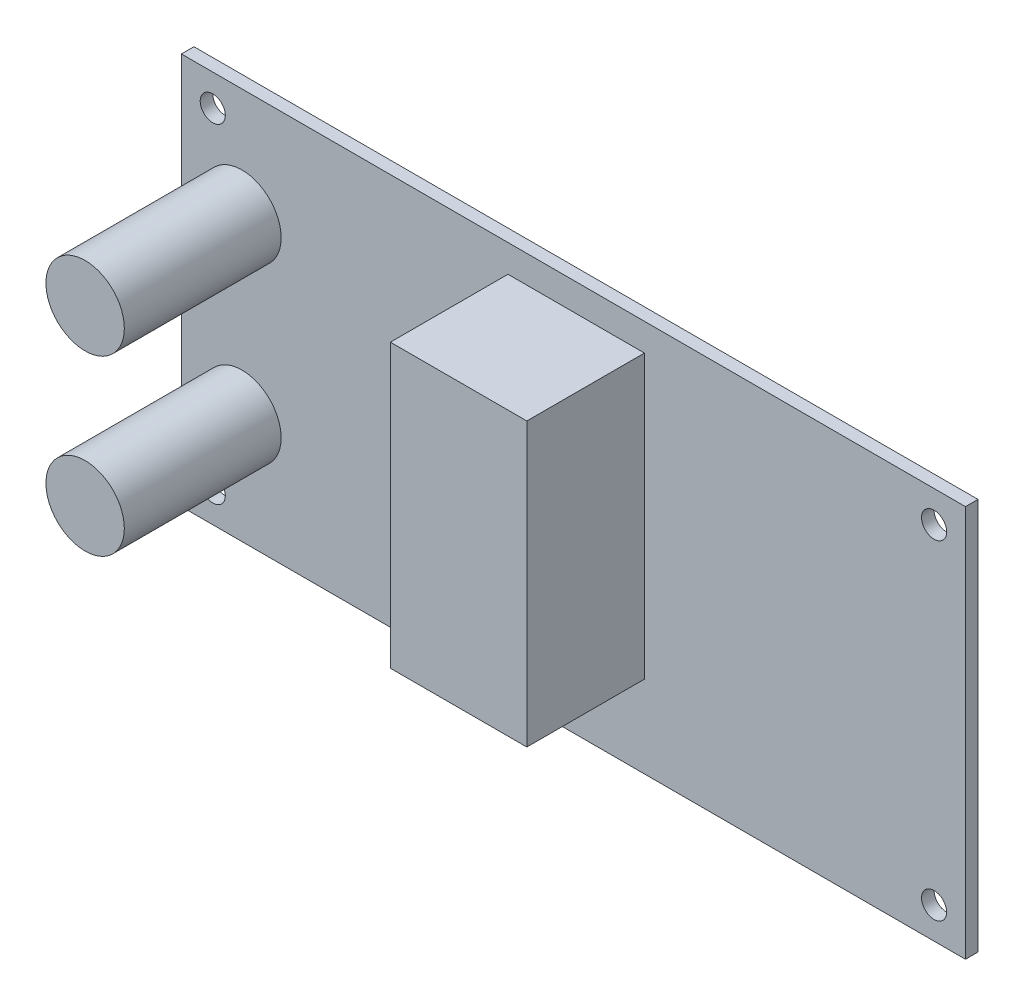
ISO-10303-21;
HEADER;
FILE_DESCRIPTION(('STEP AP214'),'2;1');
FILE_NAME('part.step','',(''),(''),'','','');
FILE_SCHEMA(('AUTOMOTIVE_DESIGN { 1 0 10303 214 1 1 1 1 }'));
ENDSEC;
DATA;
#1=APPLICATION_CONTEXT('core data for automotive mechanical design processes');
#2=APPLICATION_PROTOCOL_DEFINITION('international standard','automotive_design',2000,#1);
#3=PRODUCT_CONTEXT('',#1,'mechanical');
#4=PRODUCT('Part','Part','',(#3));
#5=PRODUCT_RELATED_PRODUCT_CATEGORY('part','',(#4));
#6=PRODUCT_DEFINITION_FORMATION('','',#4);
#7=PRODUCT_DEFINITION_CONTEXT('part definition',#1,'design');
#8=PRODUCT_DEFINITION('design','',#6,#7);
#9=PRODUCT_DEFINITION_SHAPE('','',#8);
#10=(LENGTH_UNIT() NAMED_UNIT(*) SI_UNIT(.MILLI.,.METRE.));
#11=(NAMED_UNIT(*) PLANE_ANGLE_UNIT() SI_UNIT($,.RADIAN.));
#12=(NAMED_UNIT(*) SI_UNIT($,.STERADIAN.) SOLID_ANGLE_UNIT());
#13=UNCERTAINTY_MEASURE_WITH_UNIT(LENGTH_MEASURE(1.E-05),#10,'distance_accuracy_value','');
#14=(GEOMETRIC_REPRESENTATION_CONTEXT(3) GLOBAL_UNCERTAINTY_ASSIGNED_CONTEXT((#13)) GLOBAL_UNIT_ASSIGNED_CONTEXT((#10,
#11,#12)) REPRESENTATION_CONTEXT('',''));
#15=CARTESIAN_POINT('',(0.,0.,0.));
#16=DIRECTION('',(0.,0.,1.));
#17=DIRECTION('',(1.,0.,0.));
#18=AXIS2_PLACEMENT_3D('',#15,#16,#17);
#19=CARTESIAN_POINT('',(0.,0.,1.6));
#20=DIRECTION('',(0.,0.,1.));
#21=DIRECTION('',(1.,0.,0.));
#22=AXIS2_PLACEMENT_3D('',#19,#20,#21);
#23=PLANE('',#22);
#24=CARTESIAN_POINT('',(-42.2779913170643,-11.0526398991411,1.6));
#25=DIRECTION('',(0.,0.,1.));
#26=DIRECTION('',(1.,0.,0.));
#27=AXIS2_PLACEMENT_3D('',#24,#25,#26);
#28=CIRCLE('',#27,5.);
#29=CARTESIAN_POINT('',(-37.2779913170643,-11.0526398991411,1.6));
#30=VERTEX_POINT('',#29);
#31=EDGE_CURVE('E132',#30,#30,#28,.T.);
#32=ORIENTED_EDGE('',*,*,#31,.F.);
#33=EDGE_LOOP('',(#32));
#34=FACE_BOUND('',#33,.T.);
#35=CARTESIAN_POINT('',(-42.2779913170643,11.0526398991411,1.6));
#36=DIRECTION('',(0.,0.,1.));
#37=DIRECTION('',(1.,0.,0.));
#38=AXIS2_PLACEMENT_3D('',#35,#36,#37);
#39=CIRCLE('',#38,5.);
#40=CARTESIAN_POINT('',(-37.2779913170643,11.0526398991411,1.6));
#41=VERTEX_POINT('',#40);
#42=EDGE_CURVE('E141',#41,#41,#39,.T.);
#43=ORIENTED_EDGE('',*,*,#42,.F.);
#44=EDGE_LOOP('',(#43));
#45=FACE_BOUND('',#44,.T.);
#46=CARTESIAN_POINT('',(46.,-21.,1.6));
#47=DIRECTION('',(0.,0.,1.));
#48=DIRECTION('',(1.,0.,0.));
#49=AXIS2_PLACEMENT_3D('',#46,#47,#48);
#50=CIRCLE('',#49,1.6);
#51=CARTESIAN_POINT('',(47.6,-21.,1.6));
#52=VERTEX_POINT('',#51);
#53=EDGE_CURVE('E155',#52,#52,#50,.T.);
#54=ORIENTED_EDGE('',*,*,#53,.F.);
#55=EDGE_LOOP('',(#54));
#56=FACE_BOUND('',#55,.T.);
#57=CARTESIAN_POINT('',(-46.,21.,1.6));
#58=DIRECTION('',(0.,0.,1.));
#59=DIRECTION('',(1.,0.,0.));
#60=AXIS2_PLACEMENT_3D('',#57,#58,#59);
#61=CIRCLE('',#60,1.6);
#62=CARTESIAN_POINT('',(-44.4,21.,1.6));
#63=VERTEX_POINT('',#62);
#64=EDGE_CURVE('E167',#63,#63,#61,.T.);
#65=ORIENTED_EDGE('',*,*,#64,.F.);
#66=EDGE_LOOP('',(#65));
#67=FACE_BOUND('',#66,.T.);
#68=DIRECTION('',(0.,-1.,0.));
#69=VECTOR('',#68,1.);
#70=CARTESIAN_POINT('',(-50.,25.,1.6));
#71=LINE('',#70,#69);
#72=CARTESIAN_POINT('',(-50.,25.,1.6));
#73=VERTEX_POINT('',#72);
#74=CARTESIAN_POINT('',(-50.,-25.,1.6));
#75=VERTEX_POINT('',#74);
#76=EDGE_CURVE('E173',#73,#75,#71,.T.);
#77=ORIENTED_EDGE('',*,*,#76,.T.);
#78=DIRECTION('',(1.,0.,0.));
#79=VECTOR('',#78,1.);
#80=CARTESIAN_POINT('',(-50.,-25.,1.6));
#81=LINE('',#80,#79);
#82=CARTESIAN_POINT('',(50.,-25.,1.6));
#83=VERTEX_POINT('',#82);
#84=EDGE_CURVE('E85',#75,#83,#81,.T.);
#85=ORIENTED_EDGE('',*,*,#84,.T.);
#86=DIRECTION('',(0.,1.,0.));
#87=VECTOR('',#86,1.);
#88=CARTESIAN_POINT('',(50.,25.,1.6));
#89=LINE('',#88,#87);
#90=CARTESIAN_POINT('',(50.,25.,1.6));
#91=VERTEX_POINT('',#90);
#92=EDGE_CURVE('E176',#83,#91,#89,.T.);
#93=ORIENTED_EDGE('',*,*,#92,.T.);
#94=DIRECTION('',(-1.,0.,0.));
#95=VECTOR('',#94,1.);
#96=CARTESIAN_POINT('',(-50.,25.,1.6));
#97=LINE('',#96,#95);
#98=EDGE_CURVE('E57',#91,#73,#97,.T.);
#99=ORIENTED_EDGE('',*,*,#98,.T.);
#100=EDGE_LOOP('',(#77,#85,#93,#99));
#101=FACE_BOUND('',#100,.T.);
#102=CARTESIAN_POINT('',(46.,21.,1.6));
#103=DIRECTION('',(0.,0.,1.));
#104=DIRECTION('',(1.,0.,0.));
#105=AXIS2_PLACEMENT_3D('',#102,#103,#104);
#106=CIRCLE('',#105,1.6);
#107=CARTESIAN_POINT('',(47.6,21.,1.6));
#108=VERTEX_POINT('',#107);
#109=EDGE_CURVE('E161',#108,#108,#106,.T.);
#110=ORIENTED_EDGE('',*,*,#109,.F.);
#111=EDGE_LOOP('',(#110));
#112=FACE_BOUND('',#111,.T.);
#113=CARTESIAN_POINT('',(-46.,-21.,1.6));
#114=DIRECTION('',(0.,0.,1.));
#115=DIRECTION('',(1.,0.,0.));
#116=AXIS2_PLACEMENT_3D('',#113,#114,#115);
#117=CIRCLE('',#116,1.6);
#118=CARTESIAN_POINT('',(-44.4,-21.,1.6));
#119=VERTEX_POINT('',#118);
#120=EDGE_CURVE('E149',#119,#119,#117,.T.);
#121=ORIENTED_EDGE('',*,*,#120,.F.);
#122=EDGE_LOOP('',(#121));
#123=FACE_BOUND('',#122,.T.);
#124=DIRECTION('',(1.,0.,0.));
#125=VECTOR('',#124,1.);
#126=CARTESIAN_POINT('',(-8.3462200102673,-14.5275744955313,1.6));
#127=LINE('',#126,#125);
#128=CARTESIAN_POINT('',(-8.3462200102673,-14.5275744955313,1.6));
#129=VERTEX_POINT('',#128);
#130=CARTESIAN_POINT('',(9.05658044007396,-14.5275744955313,1.6));
#131=VERTEX_POINT('',#130);
#132=EDGE_CURVE('E383',#129,#131,#127,.T.);
#133=ORIENTED_EDGE('',*,*,#132,.F.);
#134=DIRECTION('',(0.,-1.,0.));
#135=VECTOR('',#134,1.);
#136=CARTESIAN_POINT('',(-8.3462200102673,21.4909556415677,1.6));
#137=LINE('',#136,#135);
#138=CARTESIAN_POINT('',(-8.3462200102673,21.4909556415677,1.6));
#139=VERTEX_POINT('',#138);
#140=EDGE_CURVE('E130',#139,#129,#137,.T.);
#141=ORIENTED_EDGE('',*,*,#140,.F.);
#142=DIRECTION('',(-1.,0.,0.));
#143=VECTOR('',#142,1.);
#144=CARTESIAN_POINT('',(-8.3462200102673,21.4909556415677,1.6));
#145=LINE('',#144,#143);
#146=CARTESIAN_POINT('',(9.05658044007396,21.4909556415677,1.6));
#147=VERTEX_POINT('',#146);
#148=EDGE_CURVE('E126',#147,#139,#145,.T.);
#149=ORIENTED_EDGE('',*,*,#148,.F.);
#150=DIRECTION('',(0.,1.,0.));
#151=VECTOR('',#150,1.);
#152=CARTESIAN_POINT('',(9.05658044007396,21.4909556415677,1.6));
#153=LINE('',#152,#151);
#154=EDGE_CURVE('E380',#131,#147,#153,.T.);
#155=ORIENTED_EDGE('',*,*,#154,.F.);
#156=EDGE_LOOP('',(#133,#141,#149,#155));
#157=FACE_BOUND('',#156,.T.);
#158=ADVANCED_FACE('F33',(#34,#45,#56,#67,#101,#112,#123,#157),#23,.T.);
#159=CARTESIAN_POINT('',(0.,0.,0.));
#160=DIRECTION('',(0.,0.,1.));
#161=DIRECTION('',(1.,0.,0.));
#162=AXIS2_PLACEMENT_3D('',#159,#160,#161);
#163=PLANE('',#162);
#164=DIRECTION('',(0.,-1.,0.));
#165=VECTOR('',#164,1.);
#166=CARTESIAN_POINT('',(-50.,25.,0.));
#167=LINE('',#166,#165);
#168=CARTESIAN_POINT('',(-50.,25.,0.));
#169=VERTEX_POINT('',#168);
#170=CARTESIAN_POINT('',(-50.,-25.,0.));
#171=VERTEX_POINT('',#170);
#172=EDGE_CURVE('E170',#169,#171,#167,.T.);
#173=ORIENTED_EDGE('',*,*,#172,.F.);
#174=DIRECTION('',(-1.,0.,0.));
#175=VECTOR('',#174,1.);
#176=CARTESIAN_POINT('',(-50.,25.,0.));
#177=LINE('',#176,#175);
#178=CARTESIAN_POINT('',(50.,25.,0.));
#179=VERTEX_POINT('',#178);
#180=EDGE_CURVE('E78',#179,#169,#177,.T.);
#181=ORIENTED_EDGE('',*,*,#180,.F.);
#182=DIRECTION('',(0.,1.,0.));
#183=VECTOR('',#182,1.);
#184=CARTESIAN_POINT('',(50.,25.,0.));
#185=LINE('',#184,#183);
#186=CARTESIAN_POINT('',(50.,-25.,0.));
#187=VERTEX_POINT('',#186);
#188=EDGE_CURVE('E184',#187,#179,#185,.T.);
#189=ORIENTED_EDGE('',*,*,#188,.F.);
#190=DIRECTION('',(1.,0.,0.));
#191=VECTOR('',#190,1.);
#192=CARTESIAN_POINT('',(-50.,-25.,0.));
#193=LINE('',#192,#191);
#194=EDGE_CURVE('E182',#171,#187,#193,.T.);
#195=ORIENTED_EDGE('',*,*,#194,.F.);
#196=EDGE_LOOP('',(#173,#181,#189,#195));
#197=FACE_BOUND('',#196,.T.);
#198=CARTESIAN_POINT('',(-46.,21.,0.));
#199=DIRECTION('',(0.,0.,1.));
#200=DIRECTION('',(1.,0.,0.));
#201=AXIS2_PLACEMENT_3D('',#198,#199,#200);
#202=CIRCLE('',#201,1.6);
#203=CARTESIAN_POINT('',(-44.4,21.,0.));
#204=VERTEX_POINT('',#203);
#205=EDGE_CURVE('E164',#204,#204,#202,.T.);
#206=ORIENTED_EDGE('',*,*,#205,.T.);
#207=EDGE_LOOP('',(#206));
#208=FACE_BOUND('',#207,.T.);
#209=CARTESIAN_POINT('',(46.,21.,0.));
#210=DIRECTION('',(0.,0.,1.));
#211=DIRECTION('',(1.,0.,0.));
#212=AXIS2_PLACEMENT_3D('',#209,#210,#211);
#213=CIRCLE('',#212,1.6);
#214=CARTESIAN_POINT('',(47.6,21.,0.));
#215=VERTEX_POINT('',#214);
#216=EDGE_CURVE('E158',#215,#215,#213,.T.);
#217=ORIENTED_EDGE('',*,*,#216,.T.);
#218=EDGE_LOOP('',(#217));
#219=FACE_BOUND('',#218,.T.);
#220=CARTESIAN_POINT('',(46.,-21.,0.));
#221=DIRECTION('',(0.,0.,1.));
#222=DIRECTION('',(1.,0.,0.));
#223=AXIS2_PLACEMENT_3D('',#220,#221,#222);
#224=CIRCLE('',#223,1.6);
#225=CARTESIAN_POINT('',(47.6,-21.,0.));
#226=VERTEX_POINT('',#225);
#227=EDGE_CURVE('E152',#226,#226,#224,.T.);
#228=ORIENTED_EDGE('',*,*,#227,.T.);
#229=EDGE_LOOP('',(#228));
#230=FACE_BOUND('',#229,.T.);
#231=CARTESIAN_POINT('',(-46.,-21.,0.));
#232=DIRECTION('',(0.,0.,1.));
#233=DIRECTION('',(1.,0.,0.));
#234=AXIS2_PLACEMENT_3D('',#231,#232,#233);
#235=CIRCLE('',#234,1.6);
#236=CARTESIAN_POINT('',(-44.4,-21.,0.));
#237=VERTEX_POINT('',#236);
#238=EDGE_CURVE('E146',#237,#237,#235,.T.);
#239=ORIENTED_EDGE('',*,*,#238,.T.);
#240=EDGE_LOOP('',(#239));
#241=FACE_BOUND('',#240,.T.);
#242=ADVANCED_FACE('F197',(#197,#208,#219,#230,#241),#163,.F.);
#243=CARTESIAN_POINT('',(-50.,25.,1.6));
#244=DIRECTION('',(1.,0.,0.));
#245=DIRECTION('',(0.,0.,-1.));
#246=AXIS2_PLACEMENT_3D('',#243,#244,#245);
#247=PLANE('',#246);
#248=ORIENTED_EDGE('',*,*,#172,.T.);
#249=DIRECTION('',(0.,0.,-1.));
#250=VECTOR('',#249,1.);
#251=CARTESIAN_POINT('',(-50.,-25.,1.6));
#252=LINE('',#251,#250);
#253=EDGE_CURVE('E11',#75,#171,#252,.T.);
#254=ORIENTED_EDGE('',*,*,#253,.F.);
#255=ORIENTED_EDGE('',*,*,#76,.F.);
#256=DIRECTION('',(0.,0.,-1.));
#257=VECTOR('',#256,1.);
#258=CARTESIAN_POINT('',(-50.,25.,1.6));
#259=LINE('',#258,#257);
#260=EDGE_CURVE('E179',#73,#169,#259,.T.);
#261=ORIENTED_EDGE('',*,*,#260,.T.);
#262=EDGE_LOOP('',(#248,#254,#255,#261));
#263=FACE_BOUND('',#262,.T.);
#264=ADVANCED_FACE('F35',(#263),#247,.F.);
#265=CARTESIAN_POINT('',(-50.,-25.,1.6));
#266=DIRECTION('',(0.,1.,0.));
#267=DIRECTION('',(0.,0.,1.));
#268=AXIS2_PLACEMENT_3D('',#265,#266,#267);
#269=PLANE('',#268);
#270=ORIENTED_EDGE('',*,*,#194,.T.);
#271=DIRECTION('',(0.,0.,-1.));
#272=VECTOR('',#271,1.);
#273=CARTESIAN_POINT('',(50.,-25.,1.6));
#274=LINE('',#273,#272);
#275=EDGE_CURVE('E41',#83,#187,#274,.T.);
#276=ORIENTED_EDGE('',*,*,#275,.F.);
#277=ORIENTED_EDGE('',*,*,#84,.F.);
#278=ORIENTED_EDGE('',*,*,#253,.T.);
#279=EDGE_LOOP('',(#270,#276,#277,#278));
#280=FACE_BOUND('',#279,.T.);
#281=ADVANCED_FACE('F213',(#280),#269,.F.);
#282=CARTESIAN_POINT('',(50.,25.,1.6));
#283=DIRECTION('',(-1.,0.,0.));
#284=DIRECTION('',(0.,0.,1.));
#285=AXIS2_PLACEMENT_3D('',#282,#283,#284);
#286=PLANE('',#285);
#287=ORIENTED_EDGE('',*,*,#188,.T.);
#288=DIRECTION('',(0.,0.,-1.));
#289=VECTOR('',#288,1.);
#290=CARTESIAN_POINT('',(50.,25.,1.6));
#291=LINE('',#290,#289);
#292=EDGE_CURVE('E188',#91,#179,#291,.T.);
#293=ORIENTED_EDGE('',*,*,#292,.F.);
#294=ORIENTED_EDGE('',*,*,#92,.F.);
#295=ORIENTED_EDGE('',*,*,#275,.T.);
#296=EDGE_LOOP('',(#287,#293,#294,#295));
#297=FACE_BOUND('',#296,.T.);
#298=ADVANCED_FACE('F193',(#297),#286,.F.);
#299=CARTESIAN_POINT('',(-50.,25.,1.6));
#300=DIRECTION('',(0.,-1.,0.));
#301=DIRECTION('',(0.,0.,-1.));
#302=AXIS2_PLACEMENT_3D('',#299,#300,#301);
#303=PLANE('',#302);
#304=ORIENTED_EDGE('',*,*,#180,.T.);
#305=ORIENTED_EDGE('',*,*,#260,.F.);
#306=ORIENTED_EDGE('',*,*,#98,.F.);
#307=ORIENTED_EDGE('',*,*,#292,.T.);
#308=EDGE_LOOP('',(#304,#305,#306,#307));
#309=FACE_BOUND('',#308,.T.);
#310=ADVANCED_FACE('F202',(#309),#303,.F.);
#311=CARTESIAN_POINT('',(-46.,21.,1.6));
#312=DIRECTION('',(0.,0.,-1.));
#313=DIRECTION('',(-1.,0.,0.));
#314=AXIS2_PLACEMENT_3D('',#311,#312,#313);
#315=CYLINDRICAL_SURFACE('',#314,1.6);
#316=ORIENTED_EDGE('',*,*,#64,.T.);
#317=EDGE_LOOP('',(#316));
#318=FACE_BOUND('',#317,.T.);
#319=ORIENTED_EDGE('',*,*,#205,.F.);
#320=EDGE_LOOP('',(#319));
#321=FACE_BOUND('',#320,.T.);
#322=ADVANCED_FACE('F204',(#318,#321),#315,.F.);
#323=CARTESIAN_POINT('',(46.,21.,1.6));
#324=DIRECTION('',(0.,0.,-1.));
#325=DIRECTION('',(-1.,0.,0.));
#326=AXIS2_PLACEMENT_3D('',#323,#324,#325);
#327=CYLINDRICAL_SURFACE('',#326,1.6);
#328=ORIENTED_EDGE('',*,*,#109,.T.);
#329=EDGE_LOOP('',(#328));
#330=FACE_BOUND('',#329,.T.);
#331=ORIENTED_EDGE('',*,*,#216,.F.);
#332=EDGE_LOOP('',(#331));
#333=FACE_BOUND('',#332,.T.);
#334=ADVANCED_FACE('F210',(#330,#333),#327,.F.);
#335=CARTESIAN_POINT('',(46.,-21.,1.6));
#336=DIRECTION('',(0.,0.,-1.));
#337=DIRECTION('',(-1.,0.,0.));
#338=AXIS2_PLACEMENT_3D('',#335,#336,#337);
#339=CYLINDRICAL_SURFACE('',#338,1.6);
#340=ORIENTED_EDGE('',*,*,#53,.T.);
#341=EDGE_LOOP('',(#340));
#342=FACE_BOUND('',#341,.T.);
#343=ORIENTED_EDGE('',*,*,#227,.F.);
#344=EDGE_LOOP('',(#343));
#345=FACE_BOUND('',#344,.T.);
#346=ADVANCED_FACE('F227',(#342,#345),#339,.F.);
#347=CARTESIAN_POINT('',(-46.,-21.,1.6));
#348=DIRECTION('',(0.,0.,-1.));
#349=DIRECTION('',(-1.,0.,0.));
#350=AXIS2_PLACEMENT_3D('',#347,#348,#349);
#351=CYLINDRICAL_SURFACE('',#350,1.6);
#352=ORIENTED_EDGE('',*,*,#120,.T.);
#353=EDGE_LOOP('',(#352));
#354=FACE_BOUND('',#353,.T.);
#355=ORIENTED_EDGE('',*,*,#238,.F.);
#356=EDGE_LOOP('',(#355));
#357=FACE_BOUND('',#356,.T.);
#358=ADVANCED_FACE('F231',(#354,#357),#351,.F.);
#359=CARTESIAN_POINT('',(-42.2779913170643,11.0526398991411,21.6));
#360=DIRECTION('',(0.,0.,-1.));
#361=DIRECTION('',(-1.,0.,0.));
#362=AXIS2_PLACEMENT_3D('',#359,#360,#361);
#363=CYLINDRICAL_SURFACE('',#362,5.);
#364=CARTESIAN_POINT('',(-42.2779913170643,11.0526398991411,21.6));
#365=DIRECTION('',(0.,0.,1.));
#366=DIRECTION('',(1.,0.,0.));
#367=AXIS2_PLACEMENT_3D('',#364,#365,#366);
#368=CIRCLE('',#367,5.);
#369=CARTESIAN_POINT('',(-37.2779913170643,11.0526398991411,21.6));
#370=VERTEX_POINT('',#369);
#371=EDGE_CURVE('E143',#370,#370,#368,.T.);
#372=ORIENTED_EDGE('',*,*,#371,.F.);
#373=EDGE_LOOP('',(#372));
#374=FACE_BOUND('',#373,.T.);
#375=ORIENTED_EDGE('',*,*,#42,.T.);
#376=EDGE_LOOP('',(#375));
#377=FACE_BOUND('',#376,.T.);
#378=ADVANCED_FACE('F235',(#374,#377),#363,.T.);
#379=CARTESIAN_POINT('',(-42.2779913170643,11.0526398991411,21.6));
#380=DIRECTION('',(0.,0.,1.));
#381=DIRECTION('',(1.,0.,0.));
#382=AXIS2_PLACEMENT_3D('',#379,#380,#381);
#383=PLANE('',#382);
#384=ORIENTED_EDGE('',*,*,#371,.T.);
#385=EDGE_LOOP('',(#384));
#386=FACE_BOUND('',#385,.T.);
#387=ADVANCED_FACE('F239',(#386),#383,.T.);
#388=CARTESIAN_POINT('',(-42.2779913170643,-11.0526398991411,21.6));
#389=DIRECTION('',(0.,0.,-1.));
#390=DIRECTION('',(-1.,0.,0.));
#391=AXIS2_PLACEMENT_3D('',#388,#389,#390);
#392=CYLINDRICAL_SURFACE('',#391,5.);
#393=CARTESIAN_POINT('',(-42.2779913170643,-11.0526398991411,21.6));
#394=DIRECTION('',(0.,0.,1.));
#395=DIRECTION('',(1.,0.,0.));
#396=AXIS2_PLACEMENT_3D('',#393,#394,#395);
#397=CIRCLE('',#396,5.);
#398=CARTESIAN_POINT('',(-37.2779913170643,-11.0526398991411,21.6));
#399=VERTEX_POINT('',#398);
#400=EDGE_CURVE('E135',#399,#399,#397,.T.);
#401=ORIENTED_EDGE('',*,*,#400,.F.);
#402=EDGE_LOOP('',(#401));
#403=FACE_BOUND('',#402,.T.);
#404=ORIENTED_EDGE('',*,*,#31,.T.);
#405=EDGE_LOOP('',(#404));
#406=FACE_BOUND('',#405,.T.);
#407=ADVANCED_FACE('F243',(#403,#406),#392,.T.);
#408=CARTESIAN_POINT('',(-42.2779913170643,-11.0526398991411,21.6));
#409=DIRECTION('',(0.,0.,1.));
#410=DIRECTION('',(1.,0.,0.));
#411=AXIS2_PLACEMENT_3D('',#408,#409,#410);
#412=PLANE('',#411);
#413=ORIENTED_EDGE('',*,*,#400,.T.);
#414=EDGE_LOOP('',(#413));
#415=FACE_BOUND('',#414,.T.);
#416=ADVANCED_FACE('F247',(#415),#412,.T.);
#417=CARTESIAN_POINT('',(-8.3462200102673,21.4909556415677,16.6));
#418=DIRECTION('',(1.,0.,0.));
#419=DIRECTION('',(0.,0.,-1.));
#420=AXIS2_PLACEMENT_3D('',#417,#418,#419);
#421=PLANE('',#420);
#422=ORIENTED_EDGE('',*,*,#140,.T.);
#423=DIRECTION('',(0.,0.,-1.));
#424=VECTOR('',#423,1.);
#425=CARTESIAN_POINT('',(-8.3462200102673,-14.5275744955313,16.6));
#426=LINE('',#425,#424);
#427=CARTESIAN_POINT('',(-8.3462200102673,-14.5275744955313,16.6));
#428=VERTEX_POINT('',#427);
#429=EDGE_CURVE('E111',#428,#129,#426,.T.);
#430=ORIENTED_EDGE('',*,*,#429,.F.);
#431=DIRECTION('',(0.,-1.,0.));
#432=VECTOR('',#431,1.);
#433=CARTESIAN_POINT('',(-8.3462200102673,21.4909556415677,16.6));
#434=LINE('',#433,#432);
#435=CARTESIAN_POINT('',(-8.3462200102673,21.4909556415677,16.6));
#436=VERTEX_POINT('',#435);
#437=EDGE_CURVE('E118',#436,#428,#434,.T.);
#438=ORIENTED_EDGE('',*,*,#437,.F.);
#439=DIRECTION('',(0.,0.,-1.));
#440=VECTOR('',#439,1.);
#441=CARTESIAN_POINT('',(-8.3462200102673,21.4909556415677,16.6));
#442=LINE('',#441,#440);
#443=EDGE_CURVE('E377',#436,#139,#442,.T.);
#444=ORIENTED_EDGE('',*,*,#443,.T.);
#445=EDGE_LOOP('',(#422,#430,#438,#444));
#446=FACE_BOUND('',#445,.T.);
#447=ADVANCED_FACE('F128',(#446),#421,.F.);
#448=CARTESIAN_POINT('',(-8.3462200102673,-14.5275744955313,16.6));
#449=DIRECTION('',(0.,1.,0.));
#450=DIRECTION('',(0.,0.,1.));
#451=AXIS2_PLACEMENT_3D('',#448,#449,#450);
#452=PLANE('',#451);
#453=ORIENTED_EDGE('',*,*,#132,.T.);
#454=DIRECTION('',(0.,0.,-1.));
#455=VECTOR('',#454,1.);
#456=CARTESIAN_POINT('',(9.05658044007396,-14.5275744955313,16.6));
#457=LINE('',#456,#455);
#458=CARTESIAN_POINT('',(9.05658044007396,-14.5275744955313,16.6));
#459=VERTEX_POINT('',#458);
#460=EDGE_CURVE('E114',#459,#131,#457,.T.);
#461=ORIENTED_EDGE('',*,*,#460,.F.);
#462=DIRECTION('',(1.,0.,0.));
#463=VECTOR('',#462,1.);
#464=CARTESIAN_POINT('',(-8.3462200102673,-14.5275744955313,16.6));
#465=LINE('',#464,#463);
#466=EDGE_CURVE('E107',#428,#459,#465,.T.);
#467=ORIENTED_EDGE('',*,*,#466,.F.);
#468=ORIENTED_EDGE('',*,*,#429,.T.);
#469=EDGE_LOOP('',(#453,#461,#467,#468));
#470=FACE_BOUND('',#469,.T.);
#471=ADVANCED_FACE('F109',(#470),#452,.F.);
#472=CARTESIAN_POINT('',(9.05658044007396,21.4909556415677,16.6));
#473=DIRECTION('',(-1.,0.,0.));
#474=DIRECTION('',(0.,0.,1.));
#475=AXIS2_PLACEMENT_3D('',#472,#473,#474);
#476=PLANE('',#475);
#477=ORIENTED_EDGE('',*,*,#154,.T.);
#478=DIRECTION('',(0.,0.,-1.));
#479=VECTOR('',#478,1.);
#480=CARTESIAN_POINT('',(9.05658044007396,21.4909556415677,16.6));
#481=LINE('',#480,#479);
#482=CARTESIAN_POINT('',(9.05658044007396,21.4909556415677,16.6));
#483=VERTEX_POINT('',#482);
#484=EDGE_CURVE('E48',#483,#147,#481,.T.);
#485=ORIENTED_EDGE('',*,*,#484,.F.);
#486=DIRECTION('',(0.,1.,0.));
#487=VECTOR('',#486,1.);
#488=CARTESIAN_POINT('',(9.05658044007396,21.4909556415677,16.6));
#489=LINE('',#488,#487);
#490=EDGE_CURVE('E117',#459,#483,#489,.T.);
#491=ORIENTED_EDGE('',*,*,#490,.F.);
#492=ORIENTED_EDGE('',*,*,#460,.T.);
#493=EDGE_LOOP('',(#477,#485,#491,#492));
#494=FACE_BOUND('',#493,.T.);
#495=ADVANCED_FACE('F256',(#494),#476,.F.);
#496=CARTESIAN_POINT('',(-8.3462200102673,21.4909556415677,16.6));
#497=DIRECTION('',(0.,-1.,0.));
#498=DIRECTION('',(0.,0.,-1.));
#499=AXIS2_PLACEMENT_3D('',#496,#497,#498);
#500=PLANE('',#499);
#501=ORIENTED_EDGE('',*,*,#148,.T.);
#502=ORIENTED_EDGE('',*,*,#443,.F.);
#503=DIRECTION('',(-1.,0.,0.));
#504=VECTOR('',#503,1.);
#505=CARTESIAN_POINT('',(-8.3462200102673,21.4909556415677,16.6));
#506=LINE('',#505,#504);
#507=EDGE_CURVE('E122',#483,#436,#506,.T.);
#508=ORIENTED_EDGE('',*,*,#507,.F.);
#509=ORIENTED_EDGE('',*,*,#484,.T.);
#510=EDGE_LOOP('',(#501,#502,#508,#509));
#511=FACE_BOUND('',#510,.T.);
#512=ADVANCED_FACE('F259',(#511),#500,.F.);
#513=CARTESIAN_POINT('',(0.,0.,16.6));
#514=DIRECTION('',(0.,0.,1.));
#515=DIRECTION('',(1.,0.,0.));
#516=AXIS2_PLACEMENT_3D('',#513,#514,#515);
#517=PLANE('',#516);
#518=ORIENTED_EDGE('',*,*,#437,.T.);
#519=ORIENTED_EDGE('',*,*,#466,.T.);
#520=ORIENTED_EDGE('',*,*,#490,.T.);
#521=ORIENTED_EDGE('',*,*,#507,.T.);
#522=EDGE_LOOP('',(#518,#519,#520,#521));
#523=FACE_BOUND('',#522,.T.);
#524=ADVANCED_FACE('F121',(#523),#517,.T.);
#525=CLOSED_SHELL('',(#158,#242,#264,#281,#298,#310,#322,#334,#346,#358,#378,#387,#407,#416,
#447,#471,#495,#512,#524));
#526=MANIFOLD_SOLID_BREP('B2',#525);
#527=ADVANCED_BREP_SHAPE_REPRESENTATION('',(#18,#526),#14);
#528=SHAPE_DEFINITION_REPRESENTATION(#9,#527);
ENDSEC;
END-ISO-10303-21;
